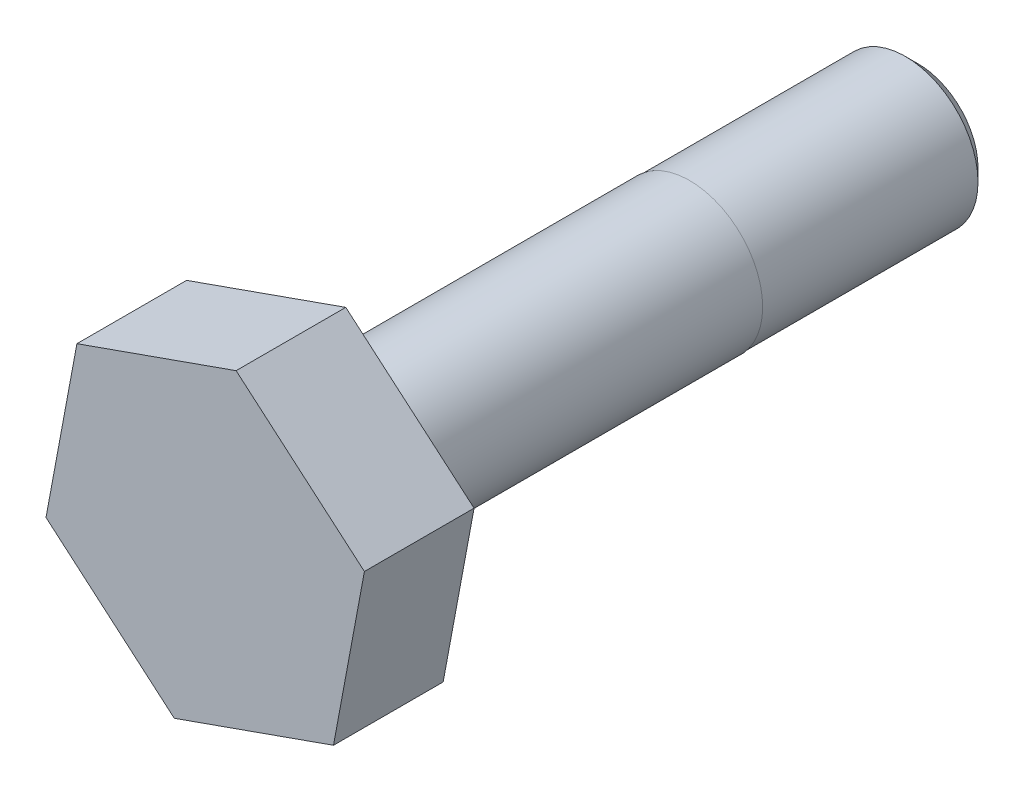
ISO-10303-21;
HEADER;
FILE_DESCRIPTION(('STEP AP214'),'2;1');
FILE_NAME('part.step','',(''),(''),'','','');
FILE_SCHEMA(('AUTOMOTIVE_DESIGN { 1 0 10303 214 1 1 1 1 }'));
ENDSEC;
DATA;
#1=APPLICATION_CONTEXT('core data for automotive mechanical design processes');
#2=APPLICATION_PROTOCOL_DEFINITION('international standard','automotive_design',2000,#1);
#3=PRODUCT_CONTEXT('',#1,'mechanical');
#4=PRODUCT('Part','Part','',(#3));
#5=PRODUCT_RELATED_PRODUCT_CATEGORY('part','',(#4));
#6=PRODUCT_DEFINITION_FORMATION('','',#4);
#7=PRODUCT_DEFINITION_CONTEXT('part definition',#1,'design');
#8=PRODUCT_DEFINITION('design','',#6,#7);
#9=PRODUCT_DEFINITION_SHAPE('','',#8);
#10=(LENGTH_UNIT() NAMED_UNIT(*) SI_UNIT(.MILLI.,.METRE.));
#11=(NAMED_UNIT(*) PLANE_ANGLE_UNIT() SI_UNIT($,.RADIAN.));
#12=(NAMED_UNIT(*) SI_UNIT($,.STERADIAN.) SOLID_ANGLE_UNIT());
#13=UNCERTAINTY_MEASURE_WITH_UNIT(LENGTH_MEASURE(1.E-05),#10,'distance_accuracy_value','');
#14=(GEOMETRIC_REPRESENTATION_CONTEXT(3) GLOBAL_UNCERTAINTY_ASSIGNED_CONTEXT((#13)) GLOBAL_UNIT_ASSIGNED_CONTEXT((#10,
#11,#12)) REPRESENTATION_CONTEXT('',''));
#15=CARTESIAN_POINT('',(0.,0.,0.));
#16=DIRECTION('',(0.,0.,1.));
#17=DIRECTION('',(1.,0.,0.));
#18=AXIS2_PLACEMENT_3D('',#15,#16,#17);
#19=CARTESIAN_POINT('',(-17.4207473605642,-6.15230808174711,12.));
#20=DIRECTION('',(-0.333003443168836,0.942925610447452,0.));
#21=DIRECTION('',(-0.942925610447452,-0.333003443168836,0.));
#22=AXIS2_PLACEMENT_3D('',#19,#20,#21);
#23=PLANE('',#22);
#24=DIRECTION('',(0.942925610447452,0.333003443168836,0.));
#25=VECTOR('',#24,1.);
#26=CARTESIAN_POINT('',(-17.4207473605642,-6.15230808174711,0.));
#27=LINE('',#26,#25);
#28=CARTESIAN_POINT('',(-17.4207473605642,-6.15230808174711,0.));
#29=VERTEX_POINT('',#28);
#30=CARTESIAN_POINT('',(0.,1.3025608664308E-13,0.));
#31=VERTEX_POINT('',#30);
#32=EDGE_CURVE('E123',#29,#31,#27,.T.);
#33=ORIENTED_EDGE('',*,*,#32,.T.);
#34=DIRECTION('',(0.,0.,-1.));
#35=VECTOR('',#34,1.);
#36=CARTESIAN_POINT('',(0.,1.3025608664308E-13,12.));
#37=LINE('',#36,#35);
#38=CARTESIAN_POINT('',(0.,1.3025608664308E-13,12.));
#39=VERTEX_POINT('',#38);
#40=EDGE_CURVE('E40',#39,#31,#37,.T.);
#41=ORIENTED_EDGE('',*,*,#40,.F.);
#42=DIRECTION('',(0.942925610447452,0.333003443168836,0.));
#43=VECTOR('',#42,1.);
#44=CARTESIAN_POINT('',(-17.4207473605642,-6.15230808174711,12.));
#45=LINE('',#44,#43);
#46=CARTESIAN_POINT('',(-17.4207473605642,-6.15230808174711,12.));
#47=VERTEX_POINT('',#46);
#48=EDGE_CURVE('E134',#47,#39,#45,.T.);
#49=ORIENTED_EDGE('',*,*,#48,.F.);
#50=DIRECTION('',(0.,0.,-1.));
#51=VECTOR('',#50,1.);
#52=CARTESIAN_POINT('',(-17.4207473605642,-6.15230808174711,12.));
#53=LINE('',#52,#51);
#54=EDGE_CURVE('E119',#47,#29,#53,.T.);
#55=ORIENTED_EDGE('',*,*,#54,.T.);
#56=EDGE_LOOP('',(#33,#41,#49,#55));
#57=FACE_BOUND('',#56,.T.);
#58=ADVANCED_FACE('F37',(#57),#23,.F.);
#59=CARTESIAN_POINT('',(0.,1.3025608664308E-13,12.));
#60=DIRECTION('',(-0.983099254110861,0.183073363891826,0.));
#61=DIRECTION('',(-0.183073363891826,-0.983099254110861,0.));
#62=AXIS2_PLACEMENT_3D('',#59,#60,#61);
#63=PLANE('',#62);
#64=DIRECTION('',(0.183073363891826,0.983099254110861,0.));
#65=VECTOR('',#64,1.);
#66=CARTESIAN_POINT('',(0.,1.3025608664308E-13,0.));
#67=LINE('',#66,#65);
#68=CARTESIAN_POINT('',(3.38231858958076,18.1629638080329,0.));
#69=VERTEX_POINT('',#68);
#70=EDGE_CURVE('E126',#31,#69,#67,.T.);
#71=ORIENTED_EDGE('',*,*,#70,.T.);
#72=DIRECTION('',(0.,0.,-1.));
#73=VECTOR('',#72,1.);
#74=CARTESIAN_POINT('',(3.38231858958076,18.1629638080329,12.));
#75=LINE('',#74,#73);
#76=CARTESIAN_POINT('',(3.38231858958076,18.1629638080329,12.));
#77=VERTEX_POINT('',#76);
#78=EDGE_CURVE('E137',#77,#69,#75,.T.);
#79=ORIENTED_EDGE('',*,*,#78,.F.);
#80=DIRECTION('',(0.183073363891826,0.983099254110861,0.));
#81=VECTOR('',#80,1.);
#82=CARTESIAN_POINT('',(0.,1.3025608664308E-13,12.));
#83=LINE('',#82,#81);
#84=EDGE_CURVE('E92',#39,#77,#83,.T.);
#85=ORIENTED_EDGE('',*,*,#84,.F.);
#86=ORIENTED_EDGE('',*,*,#40,.T.);
#87=EDGE_LOOP('',(#71,#79,#85,#86));
#88=FACE_BOUND('',#87,.T.);
#89=ADVANCED_FACE('F142',(#88),#63,.F.);
#90=CARTESIAN_POINT('',(3.38231858958076,18.1629638080329,12.));
#91=DIRECTION('',(-0.650095810942024,-0.759852246555626,0.));
#92=DIRECTION('',(0.759852246555626,-0.650095810942024,0.));
#93=AXIS2_PLACEMENT_3D('',#90,#91,#92);
#94=PLANE('',#93);
#95=DIRECTION('',(-0.759852246555626,0.650095810942024,0.));
#96=VECTOR('',#95,1.);
#97=CARTESIAN_POINT('',(3.38231858958076,18.1629638080329,0.));
#98=LINE('',#97,#96);
#99=CARTESIAN_POINT('',(-10.6561101814026,30.1736195343185,0.));
#100=VERTEX_POINT('',#99);
#101=EDGE_CURVE('E129',#69,#100,#98,.T.);
#102=ORIENTED_EDGE('',*,*,#101,.T.);
#103=DIRECTION('',(0.,0.,-1.));
#104=VECTOR('',#103,1.);
#105=CARTESIAN_POINT('',(-10.6561101814026,30.1736195343185,12.));
#106=LINE('',#105,#104);
#107=CARTESIAN_POINT('',(-10.6561101814026,30.1736195343185,12.));
#108=VERTEX_POINT('',#107);
#109=EDGE_CURVE('E114',#108,#100,#106,.T.);
#110=ORIENTED_EDGE('',*,*,#109,.F.);
#111=DIRECTION('',(-0.759852246555626,0.650095810942024,0.));
#112=VECTOR('',#111,1.);
#113=CARTESIAN_POINT('',(3.38231858958076,18.1629638080329,12.));
#114=LINE('',#113,#112);
#115=EDGE_CURVE('E105',#77,#108,#114,.T.);
#116=ORIENTED_EDGE('',*,*,#115,.F.);
#117=ORIENTED_EDGE('',*,*,#78,.T.);
#118=EDGE_LOOP('',(#102,#110,#116,#117));
#119=FACE_BOUND('',#118,.T.);
#120=ADVANCED_FACE('F148',(#119),#94,.F.);
#121=CARTESIAN_POINT('',(-10.6561101814026,30.1736195343185,12.));
#122=DIRECTION('',(0.333003443168831,-0.942925610447453,0.));
#123=DIRECTION('',(0.942925610447454,0.333003443168831,0.));
#124=AXIS2_PLACEMENT_3D('',#121,#122,#123);
#125=PLANE('',#124);
#126=DIRECTION('',(-0.942925610447454,-0.333003443168831,0.));
#127=VECTOR('',#126,1.);
#128=CARTESIAN_POINT('',(-10.6561101814026,30.1736195343185,0.));
#129=LINE('',#128,#127);
#130=CARTESIAN_POINT('',(-28.0768575419668,24.0213114525714,0.));
#131=VERTEX_POINT('',#130);
#132=EDGE_CURVE('E113',#100,#131,#129,.T.);
#133=ORIENTED_EDGE('',*,*,#132,.T.);
#134=DIRECTION('',(0.,0.,-1.));
#135=VECTOR('',#134,1.);
#136=CARTESIAN_POINT('',(-28.0768575419668,24.0213114525714,12.));
#137=LINE('',#136,#135);
#138=CARTESIAN_POINT('',(-28.0768575419668,24.0213114525714,12.));
#139=VERTEX_POINT('',#138);
#140=EDGE_CURVE('E110',#139,#131,#137,.T.);
#141=ORIENTED_EDGE('',*,*,#140,.F.);
#142=DIRECTION('',(-0.942925610447454,-0.333003443168831,0.));
#143=VECTOR('',#142,1.);
#144=CARTESIAN_POINT('',(-10.6561101814026,30.1736195343185,12.));
#145=LINE('',#144,#143);
#146=EDGE_CURVE('E99',#108,#139,#145,.T.);
#147=ORIENTED_EDGE('',*,*,#146,.F.);
#148=ORIENTED_EDGE('',*,*,#109,.T.);
#149=EDGE_LOOP('',(#133,#141,#147,#148));
#150=FACE_BOUND('',#149,.T.);
#151=ADVANCED_FACE('F111',(#150),#125,.F.);
#152=CARTESIAN_POINT('',(-28.0768575419668,24.0213114525714,12.));
#153=DIRECTION('',(0.98309925411086,-0.183073363891831,0.));
#154=DIRECTION('',(0.183073363891831,0.98309925411086,0.));
#155=AXIS2_PLACEMENT_3D('',#152,#153,#154);
#156=PLANE('',#155);
#157=DIRECTION('',(-0.183073363891831,-0.98309925411086,0.));
#158=VECTOR('',#157,1.);
#159=CARTESIAN_POINT('',(-28.0768575419668,24.0213114525714,0.));
#160=LINE('',#159,#158);
#161=CARTESIAN_POINT('',(-31.4591761315475,5.85834764453859,0.));
#162=VERTEX_POINT('',#161);
#163=EDGE_CURVE('E77',#131,#162,#160,.T.);
#164=ORIENTED_EDGE('',*,*,#163,.T.);
#165=DIRECTION('',(0.,0.,-1.));
#166=VECTOR('',#165,1.);
#167=CARTESIAN_POINT('',(-31.4591761315475,5.85834764453859,12.));
#168=LINE('',#167,#166);
#169=CARTESIAN_POINT('',(-31.4591761315475,5.85834764453859,12.));
#170=VERTEX_POINT('',#169);
#171=EDGE_CURVE('E115',#170,#162,#168,.T.);
#172=ORIENTED_EDGE('',*,*,#171,.F.);
#173=DIRECTION('',(-0.183073363891831,-0.98309925411086,0.));
#174=VECTOR('',#173,1.);
#175=CARTESIAN_POINT('',(-28.0768575419668,24.0213114525714,12.));
#176=LINE('',#175,#174);
#177=EDGE_CURVE('E103',#139,#170,#176,.T.);
#178=ORIENTED_EDGE('',*,*,#177,.F.);
#179=ORIENTED_EDGE('',*,*,#140,.T.);
#180=EDGE_LOOP('',(#164,#172,#178,#179));
#181=FACE_BOUND('',#180,.T.);
#182=ADVANCED_FACE('F117',(#181),#156,.F.);
#183=CARTESIAN_POINT('',(-31.4591761315475,5.85834764453859,12.));
#184=DIRECTION('',(0.650095810942029,0.759852246555622,0.));
#185=DIRECTION('',(-0.759852246555622,0.650095810942029,0.));
#186=AXIS2_PLACEMENT_3D('',#183,#184,#185);
#187=PLANE('',#186);
#188=DIRECTION('',(0.759852246555622,-0.650095810942028,0.));
#189=VECTOR('',#188,1.);
#190=CARTESIAN_POINT('',(-31.4591761315475,5.85834764453859,0.));
#191=LINE('',#190,#189);
#192=EDGE_CURVE('E83',#162,#29,#191,.T.);
#193=ORIENTED_EDGE('',*,*,#192,.T.);
#194=ORIENTED_EDGE('',*,*,#54,.F.);
#195=DIRECTION('',(0.759852246555622,-0.650095810942028,0.));
#196=VECTOR('',#195,1.);
#197=CARTESIAN_POINT('',(-31.4591761315475,5.85834764453859,12.));
#198=LINE('',#197,#196);
#199=EDGE_CURVE('E54',#170,#47,#198,.T.);
#200=ORIENTED_EDGE('',*,*,#199,.F.);
#201=ORIENTED_EDGE('',*,*,#171,.T.);
#202=EDGE_LOOP('',(#193,#194,#200,#201));
#203=FACE_BOUND('',#202,.T.);
#204=ADVANCED_FACE('F193',(#203),#187,.F.);
#205=CARTESIAN_POINT('',(0.,0.,12.));
#206=DIRECTION('',(0.,0.,1.));
#207=DIRECTION('',(1.,0.,0.));
#208=AXIS2_PLACEMENT_3D('',#205,#206,#207);
#209=PLANE('',#208);
#210=ORIENTED_EDGE('',*,*,#48,.T.);
#211=ORIENTED_EDGE('',*,*,#84,.T.);
#212=ORIENTED_EDGE('',*,*,#115,.T.);
#213=ORIENTED_EDGE('',*,*,#146,.T.);
#214=ORIENTED_EDGE('',*,*,#177,.T.);
#215=ORIENTED_EDGE('',*,*,#199,.T.);
#216=EDGE_LOOP('',(#210,#211,#212,#213,#214,#215));
#217=FACE_BOUND('',#216,.T.);
#218=ADVANCED_FACE('F101',(#217),#209,.T.);
#219=CARTESIAN_POINT('',(0.,0.,0.));
#220=DIRECTION('',(0.,0.,1.));
#221=DIRECTION('',(1.,0.,0.));
#222=AXIS2_PLACEMENT_3D('',#219,#220,#221);
#223=PLANE('',#222);
#224=CARTESIAN_POINT('',(-14.0384287709834,12.0106557262857,0.));
#225=DIRECTION('',(0.,0.,-1.));
#226=DIRECTION('',(-1.,0.,0.));
#227=AXIS2_PLACEMENT_3D('',#224,#225,#226);
#228=CIRCLE('',#227,8.);
#229=CARTESIAN_POINT('',(-22.0384287709834,12.0106557262857,0.));
#230=VERTEX_POINT('',#229);
#231=EDGE_CURVE('E11',#230,#230,#228,.T.);
#232=ORIENTED_EDGE('',*,*,#231,.F.);
#233=EDGE_LOOP('',(#232));
#234=FACE_BOUND('',#233,.T.);
#235=ORIENTED_EDGE('',*,*,#32,.F.);
#236=ORIENTED_EDGE('',*,*,#192,.F.);
#237=ORIENTED_EDGE('',*,*,#163,.F.);
#238=ORIENTED_EDGE('',*,*,#132,.F.);
#239=ORIENTED_EDGE('',*,*,#101,.F.);
#240=ORIENTED_EDGE('',*,*,#70,.F.);
#241=EDGE_LOOP('',(#235,#236,#237,#238,#239,#240));
#242=FACE_BOUND('',#241,.T.);
#243=ADVANCED_FACE('F147',(#234,#242),#223,.F.);
#244=CARTESIAN_POINT('',(-14.0384287709834,12.0106557262857,-66.));
#245=DIRECTION('',(0.,0.,1.));
#246=DIRECTION('',(1.,0.,0.));
#247=AXIS2_PLACEMENT_3D('',#244,#245,#246);
#248=CYLINDRICAL_SURFACE('',#247,8.);
#249=CARTESIAN_POINT('',(-14.0384287709834,12.0106557262857,-41.));
#250=DIRECTION('',(0.,0.,1.));
#251=DIRECTION('',(1.,0.,0.));
#252=AXIS2_PLACEMENT_3D('',#249,#250,#251);
#253=CIRCLE('',#252,8.);
#254=CARTESIAN_POINT('',(-6.03842877098339,12.0106557262857,-41.));
#255=VERTEX_POINT('',#254);
#256=EDGE_CURVE('E154',#255,#255,#253,.T.);
#257=ORIENTED_EDGE('',*,*,#256,.T.);
#258=EDGE_LOOP('',(#257));
#259=FACE_BOUND('',#258,.T.);
#260=ORIENTED_EDGE('',*,*,#231,.T.);
#261=EDGE_LOOP('',(#260));
#262=FACE_BOUND('',#261,.T.);
#263=ADVANCED_FACE('F198',(#259,#262),#248,.T.);
#264=CARTESIAN_POINT('',(-14.0384287709834,12.0106557262857,-66.));
#265=DIRECTION('',(0.,0.,1.));
#266=DIRECTION('',(1.,0.,0.));
#267=AXIS2_PLACEMENT_3D('',#264,#265,#266);
#268=CYLINDRICAL_SURFACE('',#267,7.9375);
#269=CARTESIAN_POINT('',(-14.0384287709834,12.0106557262857,-41.));
#270=DIRECTION('',(0.,0.,1.));
#271=DIRECTION('',(1.,0.,0.));
#272=AXIS2_PLACEMENT_3D('',#269,#270,#271);
#273=CIRCLE('',#272,7.9375);
#274=CARTESIAN_POINT('',(-6.10092877098339,12.0106557262857,-41.));
#275=VERTEX_POINT('',#274);
#276=EDGE_CURVE('E127',#275,#275,#273,.T.);
#277=ORIENTED_EDGE('',*,*,#276,.F.);
#278=EDGE_LOOP('',(#277));
#279=FACE_BOUND('',#278,.T.);
#280=CARTESIAN_POINT('',(-14.0384287709834,12.0106557262857,-64.62586));
#281=DIRECTION('',(0.,0.,1.));
#282=DIRECTION('',(1.,0.,0.));
#283=AXIS2_PLACEMENT_3D('',#280,#281,#282);
#284=CIRCLE('',#283,7.9375);
#285=CARTESIAN_POINT('',(-6.10092877098339,12.0106557262857,-64.62586));
#286=VERTEX_POINT('',#285);
#287=EDGE_CURVE('E160',#286,#286,#284,.T.);
#288=ORIENTED_EDGE('',*,*,#287,.T.);
#289=EDGE_LOOP('',(#288));
#290=FACE_BOUND('',#289,.T.);
#291=ADVANCED_FACE('F164',(#279,#290),#268,.T.);
#292=CARTESIAN_POINT('',(-6.10092877098339,12.0106557262857,-41.));
#293=DIRECTION('',(0.,0.,1.));
#294=DIRECTION('',(1.,0.,0.));
#295=AXIS2_PLACEMENT_3D('',#292,#293,#294);
#296=PLANE('',#295);
#297=ORIENTED_EDGE('',*,*,#256,.F.);
#298=EDGE_LOOP('',(#297));
#299=FACE_BOUND('',#298,.T.);
#300=ORIENTED_EDGE('',*,*,#276,.T.);
#301=EDGE_LOOP('',(#300));
#302=FACE_BOUND('',#301,.T.);
#303=ADVANCED_FACE('F170',(#299,#302),#296,.F.);
#304=CARTESIAN_POINT('',(-14.0384287709834,12.0106557262857,-66.));
#305=DIRECTION('',(0.,0.,1.));
#306=DIRECTION('',(1.,0.,0.));
#307=AXIS2_PLACEMENT_3D('',#304,#305,#306);
#308=CONICAL_SURFACE('',#307,6.56336,0.785398163397454);
#309=ORIENTED_EDGE('',*,*,#287,.F.);
#310=EDGE_LOOP('',(#309));
#311=FACE_BOUND('',#310,.T.);
#312=CARTESIAN_POINT('',(-14.0384287709834,12.0106557262857,-66.));
#313=DIRECTION('',(0.,0.,1.));
#314=DIRECTION('',(1.,0.,0.));
#315=AXIS2_PLACEMENT_3D('',#312,#313,#314);
#316=CIRCLE('',#315,6.56336);
#317=CARTESIAN_POINT('',(-7.47506877098339,12.0106557262857,-66.));
#318=VERTEX_POINT('',#317);
#319=EDGE_CURVE('E157',#318,#318,#316,.T.);
#320=ORIENTED_EDGE('',*,*,#319,.T.);
#321=EDGE_LOOP('',(#320));
#322=FACE_BOUND('',#321,.T.);
#323=ADVANCED_FACE('F166',(#311,#322),#308,.T.);
#324=CARTESIAN_POINT('',(-14.0384287709834,12.0106557262857,-66.));
#325=DIRECTION('',(0.,0.,-1.));
#326=DIRECTION('',(-1.,0.,0.));
#327=AXIS2_PLACEMENT_3D('',#324,#325,#326);
#328=PLANE('',#327);
#329=ORIENTED_EDGE('',*,*,#319,.F.);
#330=EDGE_LOOP('',(#329));
#331=FACE_BOUND('',#330,.T.);
#332=ADVANCED_FACE('F169',(#331),#328,.T.);
#333=CLOSED_SHELL('',(#58,#89,#120,#151,#182,#204,#218,#243,#263,#291,#303,#323,#332));
#334=MANIFOLD_SOLID_BREP('B2',#333);
#335=ADVANCED_BREP_SHAPE_REPRESENTATION('',(#18,#334),#14);
#336=SHAPE_DEFINITION_REPRESENTATION(#9,#335);
ENDSEC;
END-ISO-10303-21;
